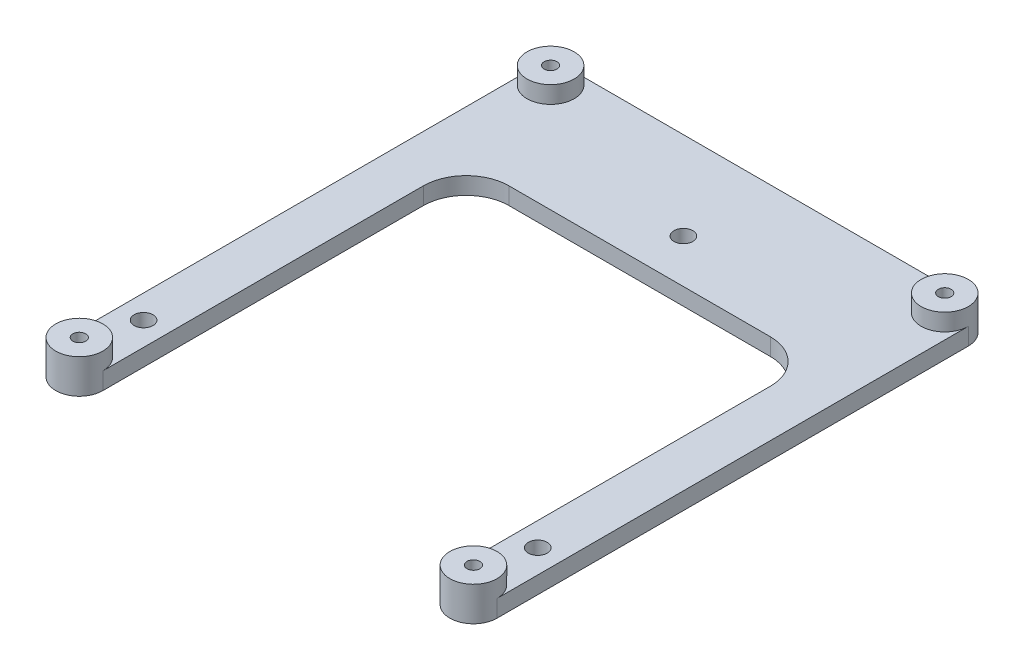
ISO-10303-21;
HEADER;
FILE_DESCRIPTION(('STEP AP214'),'2;1');
FILE_NAME('part.step','',(''),(''),'','','');
FILE_SCHEMA(('AUTOMOTIVE_DESIGN { 1 0 10303 214 1 1 1 1 }'));
ENDSEC;
DATA;
#1=APPLICATION_CONTEXT('core data for automotive mechanical design processes');
#2=APPLICATION_PROTOCOL_DEFINITION('international standard','automotive_design',2000,#1);
#3=PRODUCT_CONTEXT('',#1,'mechanical');
#4=PRODUCT('Part','Part','',(#3));
#5=PRODUCT_RELATED_PRODUCT_CATEGORY('part','',(#4));
#6=PRODUCT_DEFINITION_FORMATION('','',#4);
#7=PRODUCT_DEFINITION_CONTEXT('part definition',#1,'design');
#8=PRODUCT_DEFINITION('design','',#6,#7);
#9=PRODUCT_DEFINITION_SHAPE('','',#8);
#10=(LENGTH_UNIT() NAMED_UNIT(*) SI_UNIT(.MILLI.,.METRE.));
#11=(NAMED_UNIT(*) PLANE_ANGLE_UNIT() SI_UNIT($,.RADIAN.));
#12=(NAMED_UNIT(*) SI_UNIT($,.STERADIAN.) SOLID_ANGLE_UNIT());
#13=UNCERTAINTY_MEASURE_WITH_UNIT(LENGTH_MEASURE(1.E-05),#10,'distance_accuracy_value','');
#14=(GEOMETRIC_REPRESENTATION_CONTEXT(3) GLOBAL_UNCERTAINTY_ASSIGNED_CONTEXT((#13)) GLOBAL_UNIT_ASSIGNED_CONTEXT((#10,
#11,#12)) REPRESENTATION_CONTEXT('',''));
#15=CARTESIAN_POINT('',(0.,0.,0.));
#16=DIRECTION('',(0.,0.,1.));
#17=DIRECTION('',(1.,0.,0.));
#18=AXIS2_PLACEMENT_3D('',#15,#16,#17);
#19=CARTESIAN_POINT('',(0.,2.,0.));
#20=DIRECTION('',(0.,-1.,0.));
#21=DIRECTION('',(0.,0.,-1.));
#22=AXIS2_PLACEMENT_3D('',#19,#20,#21);
#23=PLANE('',#22);
#24=CARTESIAN_POINT('',(0.,2.,0.));
#25=DIRECTION('',(0.,1.,0.));
#26=DIRECTION('',(0.,0.,1.));
#27=AXIS2_PLACEMENT_3D('',#24,#25,#26);
#28=CIRCLE('',#27,1.1);
#29=CARTESIAN_POINT('',(0.,2.,1.1));
#30=VERTEX_POINT('',#29);
#31=EDGE_CURVE('E571',#30,#30,#28,.T.);
#32=ORIENTED_EDGE('',*,*,#31,.F.);
#33=EDGE_LOOP('',(#32));
#34=FACE_BOUND('',#33,.T.);
#35=CARTESIAN_POINT('',(46.,2.,0.));
#36=DIRECTION('',(0.,1.,0.));
#37=DIRECTION('',(0.,0.,1.));
#38=AXIS2_PLACEMENT_3D('',#35,#36,#37);
#39=CIRCLE('',#38,1.1);
#40=CARTESIAN_POINT('',(46.,2.,1.1));
#41=VERTEX_POINT('',#40);
#42=EDGE_CURVE('E576',#41,#41,#39,.T.);
#43=ORIENTED_EDGE('',*,*,#42,.F.);
#44=EDGE_LOOP('',(#43));
#45=FACE_BOUND('',#44,.T.);
#46=CARTESIAN_POINT('',(23.,2.,-40.));
#47=DIRECTION('',(0.,1.,0.));
#48=DIRECTION('',(0.,0.,1.));
#49=AXIS2_PLACEMENT_3D('',#46,#47,#48);
#50=CIRCLE('',#49,1.09999999999999);
#51=CARTESIAN_POINT('',(23.,2.,-38.9));
#52=VERTEX_POINT('',#51);
#53=EDGE_CURVE('E570',#52,#52,#50,.T.);
#54=ORIENTED_EDGE('',*,*,#53,.F.);
#55=EDGE_LOOP('',(#54));
#56=FACE_BOUND('',#55,.T.);
#57=DIRECTION('',(0.,0.,1.));
#58=VECTOR('',#57,1.);
#59=CARTESIAN_POINT('',(2.75,2.,0.));
#60=LINE('',#59,#58);
#61=CARTESIAN_POINT('',(2.75,2.,-29.9));
#62=VERTEX_POINT('',#61);
#63=CARTESIAN_POINT('',(2.75,2.,7.5));
#64=VERTEX_POINT('',#63);
#65=EDGE_CURVE('E474',#62,#64,#60,.T.);
#66=ORIENTED_EDGE('',*,*,#65,.F.);
#67=CARTESIAN_POINT('',(7.75,2.,-29.9));
#68=DIRECTION('',(0.,-1.,0.));
#69=DIRECTION('',(0.,0.,-1.));
#70=AXIS2_PLACEMENT_3D('',#67,#68,#69);
#71=CIRCLE('',#70,5.);
#72=CARTESIAN_POINT('',(7.75,2.,-34.9));
#73=VERTEX_POINT('',#72);
#74=EDGE_CURVE('E12',#62,#73,#71,.T.);
#75=ORIENTED_EDGE('',*,*,#74,.T.);
#76=DIRECTION('',(-1.,0.,0.));
#77=VECTOR('',#76,1.);
#78=CARTESIAN_POINT('',(0.,2.,-34.9));
#79=LINE('',#78,#77);
#80=CARTESIAN_POINT('',(38.25,2.,-34.9));
#81=VERTEX_POINT('',#80);
#82=EDGE_CURVE('E477',#81,#73,#79,.T.);
#83=ORIENTED_EDGE('',*,*,#82,.F.);
#84=CARTESIAN_POINT('',(38.25,2.,-29.9));
#85=DIRECTION('',(0.,-1.,0.));
#86=DIRECTION('',(0.,0.,-1.));
#87=AXIS2_PLACEMENT_3D('',#84,#85,#86);
#88=CIRCLE('',#87,5.);
#89=CARTESIAN_POINT('',(43.25,2.,-29.9));
#90=VERTEX_POINT('',#89);
#91=EDGE_CURVE('E148',#81,#90,#88,.T.);
#92=ORIENTED_EDGE('',*,*,#91,.T.);
#93=DIRECTION('',(0.,0.,-1.));
#94=VECTOR('',#93,1.);
#95=CARTESIAN_POINT('',(43.25,2.,0.));
#96=LINE('',#95,#94);
#97=CARTESIAN_POINT('',(43.25,2.,7.5));
#98=VERTEX_POINT('',#97);
#99=EDGE_CURVE('E132',#98,#90,#96,.T.);
#100=ORIENTED_EDGE('',*,*,#99,.F.);
#101=CARTESIAN_POINT('',(46.,2.,7.5));
#102=DIRECTION('',(0.,-1.,0.));
#103=DIRECTION('',(0.,0.,-1.));
#104=AXIS2_PLACEMENT_3D('',#101,#102,#103);
#105=CIRCLE('',#104,2.75);
#106=CARTESIAN_POINT('',(48.75,2.,7.5));
#107=VERTEX_POINT('',#106);
#108=EDGE_CURVE('E145',#107,#98,#105,.F.);
#109=ORIENTED_EDGE('',*,*,#108,.F.);
#110=DIRECTION('',(0.,0.,1.));
#111=VECTOR('',#110,1.);
#112=CARTESIAN_POINT('',(48.75,2.,0.));
#113=LINE('',#112,#111);
#114=CARTESIAN_POINT('',(48.75,2.,-47.5));
#115=VERTEX_POINT('',#114);
#116=EDGE_CURVE('E535',#115,#107,#113,.T.);
#117=ORIENTED_EDGE('',*,*,#116,.F.);
#118=CARTESIAN_POINT('',(46.,2.,-47.5));
#119=DIRECTION('',(0.,-1.,0.));
#120=DIRECTION('',(0.,0.,-1.));
#121=AXIS2_PLACEMENT_3D('',#118,#119,#120);
#122=CIRCLE('',#121,2.75);
#123=CARTESIAN_POINT('',(46.,2.,-50.25));
#124=VERTEX_POINT('',#123);
#125=EDGE_CURVE('E157',#124,#115,#122,.F.);
#126=ORIENTED_EDGE('',*,*,#125,.F.);
#127=DIRECTION('',(1.,0.,0.));
#128=VECTOR('',#127,1.);
#129=CARTESIAN_POINT('',(0.,2.,-50.25));
#130=LINE('',#129,#128);
#131=CARTESIAN_POINT('',(0.,2.,-50.25));
#132=VERTEX_POINT('',#131);
#133=EDGE_CURVE('E532',#132,#124,#130,.T.);
#134=ORIENTED_EDGE('',*,*,#133,.F.);
#135=CARTESIAN_POINT('',(0.,2.,-47.5));
#136=DIRECTION('',(0.,-1.,0.));
#137=DIRECTION('',(0.,0.,-1.));
#138=AXIS2_PLACEMENT_3D('',#135,#136,#137);
#139=CIRCLE('',#138,2.75);
#140=CARTESIAN_POINT('',(-2.75,2.,-47.5));
#141=VERTEX_POINT('',#140);
#142=EDGE_CURVE('E163',#141,#132,#139,.F.);
#143=ORIENTED_EDGE('',*,*,#142,.F.);
#144=DIRECTION('',(0.,0.,-1.));
#145=VECTOR('',#144,1.);
#146=CARTESIAN_POINT('',(-2.75,2.,0.));
#147=LINE('',#146,#145);
#148=CARTESIAN_POINT('',(-2.75,2.,7.5));
#149=VERTEX_POINT('',#148);
#150=EDGE_CURVE('E513',#149,#141,#147,.T.);
#151=ORIENTED_EDGE('',*,*,#150,.F.);
#152=CARTESIAN_POINT('',(0.,2.,7.5));
#153=DIRECTION('',(0.,-1.,0.));
#154=DIRECTION('',(0.,0.,-1.));
#155=AXIS2_PLACEMENT_3D('',#152,#153,#154);
#156=CIRCLE('',#155,2.75);
#157=EDGE_CURVE('E158',#64,#149,#156,.F.);
#158=ORIENTED_EDGE('',*,*,#157,.F.);
#159=EDGE_LOOP('',(#66,#75,#83,#92,#100,#109,#117,#126,#134,#143,#151,#158));
#160=FACE_BOUND('',#159,.T.);
#161=ADVANCED_FACE('F39',(#34,#45,#56,#160),#23,.F.);
#162=CARTESIAN_POINT('',(0.,0.,0.));
#163=DIRECTION('',(0.,-1.,0.));
#164=DIRECTION('',(0.,0.,-1.));
#165=AXIS2_PLACEMENT_3D('',#162,#163,#164);
#166=PLANE('',#165);
#167=CARTESIAN_POINT('',(0.,0.,7.5));
#168=DIRECTION('',(0.,1.,0.));
#169=DIRECTION('',(0.,0.,1.));
#170=AXIS2_PLACEMENT_3D('',#167,#168,#169);
#171=CIRCLE('',#170,0.75);
#172=CARTESIAN_POINT('',(0.,0.,8.25));
#173=VERTEX_POINT('',#172);
#174=EDGE_CURVE('E583',#173,#173,#171,.T.);
#175=ORIENTED_EDGE('',*,*,#174,.T.);
#176=EDGE_LOOP('',(#175));
#177=FACE_BOUND('',#176,.T.);
#178=CARTESIAN_POINT('',(46.,0.,-47.5));
#179=DIRECTION('',(0.,1.,0.));
#180=DIRECTION('',(0.,0.,1.));
#181=AXIS2_PLACEMENT_3D('',#178,#179,#180);
#182=CIRCLE('',#181,0.749999999999999);
#183=CARTESIAN_POINT('',(46.,0.,-46.75));
#184=VERTEX_POINT('',#183);
#185=EDGE_CURVE('E592',#184,#184,#182,.T.);
#186=ORIENTED_EDGE('',*,*,#185,.T.);
#187=EDGE_LOOP('',(#186));
#188=FACE_BOUND('',#187,.T.);
#189=CARTESIAN_POINT('',(46.,0.,7.5));
#190=DIRECTION('',(0.,1.,0.));
#191=DIRECTION('',(0.,0.,1.));
#192=AXIS2_PLACEMENT_3D('',#189,#190,#191);
#193=CIRCLE('',#192,0.749999999999999);
#194=CARTESIAN_POINT('',(46.,0.,8.25));
#195=VERTEX_POINT('',#194);
#196=EDGE_CURVE('E165',#195,#195,#193,.T.);
#197=ORIENTED_EDGE('',*,*,#196,.T.);
#198=EDGE_LOOP('',(#197));
#199=FACE_BOUND('',#198,.T.);
#200=CARTESIAN_POINT('',(0.,0.,-47.5));
#201=DIRECTION('',(0.,1.,0.));
#202=DIRECTION('',(0.,0.,1.));
#203=AXIS2_PLACEMENT_3D('',#200,#201,#202);
#204=CIRCLE('',#203,0.75);
#205=CARTESIAN_POINT('',(0.,0.,-46.75));
#206=VERTEX_POINT('',#205);
#207=EDGE_CURVE('E587',#206,#206,#204,.T.);
#208=ORIENTED_EDGE('',*,*,#207,.T.);
#209=EDGE_LOOP('',(#208));
#210=FACE_BOUND('',#209,.T.);
#211=CARTESIAN_POINT('',(23.,0.,-40.));
#212=DIRECTION('',(0.,-1.,0.));
#213=DIRECTION('',(0.,0.,-1.));
#214=AXIS2_PLACEMENT_3D('',#211,#212,#213);
#215=CIRCLE('',#214,1.09999999999999);
#216=CARTESIAN_POINT('',(23.,0.,-41.1));
#217=VERTEX_POINT('',#216);
#218=EDGE_CURVE('E575',#217,#217,#215,.T.);
#219=ORIENTED_EDGE('',*,*,#218,.F.);
#220=EDGE_LOOP('',(#219));
#221=FACE_BOUND('',#220,.T.);
#222=CARTESIAN_POINT('',(46.,0.,0.));
#223=DIRECTION('',(0.,-1.,0.));
#224=DIRECTION('',(0.,0.,-1.));
#225=AXIS2_PLACEMENT_3D('',#222,#223,#224);
#226=CIRCLE('',#225,1.1);
#227=CARTESIAN_POINT('',(46.,0.,-1.1));
#228=VERTEX_POINT('',#227);
#229=EDGE_CURVE('E602',#228,#228,#226,.T.);
#230=ORIENTED_EDGE('',*,*,#229,.F.);
#231=EDGE_LOOP('',(#230));
#232=FACE_BOUND('',#231,.T.);
#233=CARTESIAN_POINT('',(0.,0.,0.));
#234=DIRECTION('',(0.,-1.,0.));
#235=DIRECTION('',(0.,0.,-1.));
#236=AXIS2_PLACEMENT_3D('',#233,#234,#235);
#237=CIRCLE('',#236,1.1);
#238=CARTESIAN_POINT('',(0.,0.,-1.1));
#239=VERTEX_POINT('',#238);
#240=EDGE_CURVE('E588',#239,#239,#237,.T.);
#241=ORIENTED_EDGE('',*,*,#240,.F.);
#242=EDGE_LOOP('',(#241));
#243=FACE_BOUND('',#242,.T.);
#244=DIRECTION('',(-1.,0.,0.));
#245=VECTOR('',#244,1.);
#246=CARTESIAN_POINT('',(0.,0.,-34.9));
#247=LINE('',#246,#245);
#248=CARTESIAN_POINT('',(38.25,0.,-34.9));
#249=VERTEX_POINT('',#248);
#250=CARTESIAN_POINT('',(7.75,0.,-34.9));
#251=VERTEX_POINT('',#250);
#252=EDGE_CURVE('E172',#249,#251,#247,.T.);
#253=ORIENTED_EDGE('',*,*,#252,.T.);
#254=CARTESIAN_POINT('',(7.75,0.,-29.9));
#255=DIRECTION('',(0.,-1.,0.));
#256=DIRECTION('',(0.,0.,-1.));
#257=AXIS2_PLACEMENT_3D('',#254,#255,#256);
#258=CIRCLE('',#257,5.);
#259=CARTESIAN_POINT('',(2.75,0.,-29.9));
#260=VERTEX_POINT('',#259);
#261=EDGE_CURVE('E48',#251,#260,#258,.F.);
#262=ORIENTED_EDGE('',*,*,#261,.T.);
#263=DIRECTION('',(0.,0.,1.));
#264=VECTOR('',#263,1.);
#265=CARTESIAN_POINT('',(2.75,0.,0.));
#266=LINE('',#265,#264);
#267=CARTESIAN_POINT('',(2.75,0.,7.5));
#268=VERTEX_POINT('',#267);
#269=EDGE_CURVE('E150',#260,#268,#266,.T.);
#270=ORIENTED_EDGE('',*,*,#269,.T.);
#271=CARTESIAN_POINT('',(0.,0.,7.5));
#272=DIRECTION('',(0.,1.,0.));
#273=DIRECTION('',(0.,0.,1.));
#274=AXIS2_PLACEMENT_3D('',#271,#272,#273);
#275=CIRCLE('',#274,2.75);
#276=CARTESIAN_POINT('',(-2.75,0.,7.5));
#277=VERTEX_POINT('',#276);
#278=EDGE_CURVE('E491',#277,#268,#275,.T.);
#279=ORIENTED_EDGE('',*,*,#278,.F.);
#280=DIRECTION('',(0.,0.,1.));
#281=VECTOR('',#280,1.);
#282=CARTESIAN_POINT('',(-2.75,0.,-47.5));
#283=LINE('',#282,#281);
#284=CARTESIAN_POINT('',(-2.75,0.,-47.5));
#285=VERTEX_POINT('',#284);
#286=EDGE_CURVE('E484',#285,#277,#283,.T.);
#287=ORIENTED_EDGE('',*,*,#286,.F.);
#288=CARTESIAN_POINT('',(0.,0.,-47.5));
#289=DIRECTION('',(0.,1.,0.));
#290=DIRECTION('',(0.,0.,-1.));
#291=AXIS2_PLACEMENT_3D('',#288,#289,#290);
#292=CIRCLE('',#291,2.75);
#293=CARTESIAN_POINT('',(0.,0.,-50.25));
#294=VERTEX_POINT('',#293);
#295=EDGE_CURVE('E480',#294,#285,#292,.T.);
#296=ORIENTED_EDGE('',*,*,#295,.F.);
#297=DIRECTION('',(-1.,0.,0.));
#298=VECTOR('',#297,1.);
#299=CARTESIAN_POINT('',(46.,0.,-50.25));
#300=LINE('',#299,#298);
#301=CARTESIAN_POINT('',(46.,0.,-50.25));
#302=VERTEX_POINT('',#301);
#303=EDGE_CURVE('E505',#302,#294,#300,.T.);
#304=ORIENTED_EDGE('',*,*,#303,.F.);
#305=CARTESIAN_POINT('',(46.,0.,-47.5));
#306=DIRECTION('',(0.,1.,0.));
#307=DIRECTION('',(0.,0.,1.));
#308=AXIS2_PLACEMENT_3D('',#305,#306,#307);
#309=CIRCLE('',#308,2.75);
#310=CARTESIAN_POINT('',(48.75,0.,-47.5));
#311=VERTEX_POINT('',#310);
#312=EDGE_CURVE('E501',#311,#302,#309,.T.);
#313=ORIENTED_EDGE('',*,*,#312,.F.);
#314=DIRECTION('',(0.,0.,-1.));
#315=VECTOR('',#314,1.);
#316=CARTESIAN_POINT('',(48.75,0.,7.5));
#317=LINE('',#316,#315);
#318=CARTESIAN_POINT('',(48.75,0.,7.5));
#319=VERTEX_POINT('',#318);
#320=EDGE_CURVE('E497',#319,#311,#317,.T.);
#321=ORIENTED_EDGE('',*,*,#320,.F.);
#322=CARTESIAN_POINT('',(46.,0.,7.5));
#323=DIRECTION('',(0.,1.,0.));
#324=DIRECTION('',(0.,0.,-1.));
#325=AXIS2_PLACEMENT_3D('',#322,#323,#324);
#326=CIRCLE('',#325,2.75);
#327=CARTESIAN_POINT('',(43.25,0.,7.5));
#328=VERTEX_POINT('',#327);
#329=EDGE_CURVE('E494',#328,#319,#326,.T.);
#330=ORIENTED_EDGE('',*,*,#329,.F.);
#331=DIRECTION('',(0.,0.,-1.));
#332=VECTOR('',#331,1.);
#333=CARTESIAN_POINT('',(43.25,0.,0.));
#334=LINE('',#333,#332);
#335=CARTESIAN_POINT('',(43.25,0.,-29.9));
#336=VERTEX_POINT('',#335);
#337=EDGE_CURVE('E135',#328,#336,#334,.T.);
#338=ORIENTED_EDGE('',*,*,#337,.T.);
#339=CARTESIAN_POINT('',(38.25,0.,-29.9));
#340=DIRECTION('',(0.,-1.,0.));
#341=DIRECTION('',(0.,0.,-1.));
#342=AXIS2_PLACEMENT_3D('',#339,#340,#341);
#343=CIRCLE('',#342,5.);
#344=EDGE_CURVE('E187',#336,#249,#343,.F.);
#345=ORIENTED_EDGE('',*,*,#344,.T.);
#346=EDGE_LOOP('',(#253,#262,#270,#279,#287,#296,#304,#313,#321,#330,#338,#345));
#347=FACE_BOUND('',#346,.T.);
#348=ADVANCED_FACE('F193',(#177,#188,#199,#210,#221,#232,#243,#347),#166,.T.);
#349=CARTESIAN_POINT('',(46.,2.,7.5));
#350=DIRECTION('',(0.,-1.,0.));
#351=DIRECTION('',(0.,0.,-1.));
#352=AXIS2_PLACEMENT_3D('',#349,#350,#351);
#353=CYLINDRICAL_SURFACE('',#352,0.749999999999999);
#354=ORIENTED_EDGE('',*,*,#196,.F.);
#355=EDGE_LOOP('',(#354));
#356=FACE_BOUND('',#355,.T.);
#357=CARTESIAN_POINT('',(46.,4.,7.5));
#358=DIRECTION('',(0.,1.,0.));
#359=DIRECTION('',(0.,0.,1.));
#360=AXIS2_PLACEMENT_3D('',#357,#358,#359);
#361=CIRCLE('',#360,0.749999999999999);
#362=CARTESIAN_POINT('',(46.,4.,8.25));
#363=VERTEX_POINT('',#362);
#364=EDGE_CURVE('E554',#363,#363,#361,.T.);
#365=ORIENTED_EDGE('',*,*,#364,.T.);
#366=EDGE_LOOP('',(#365));
#367=FACE_BOUND('',#366,.T.);
#368=ADVANCED_FACE('F216',(#356,#367),#353,.F.);
#369=CARTESIAN_POINT('',(46.,2.,-47.5));
#370=DIRECTION('',(0.,-1.,0.));
#371=DIRECTION('',(0.,0.,-1.));
#372=AXIS2_PLACEMENT_3D('',#369,#370,#371);
#373=CYLINDRICAL_SURFACE('',#372,0.749999999999999);
#374=ORIENTED_EDGE('',*,*,#185,.F.);
#375=EDGE_LOOP('',(#374));
#376=FACE_BOUND('',#375,.T.);
#377=CARTESIAN_POINT('',(46.,4.,-47.5));
#378=DIRECTION('',(0.,1.,0.));
#379=DIRECTION('',(0.,0.,1.));
#380=AXIS2_PLACEMENT_3D('',#377,#378,#379);
#381=CIRCLE('',#380,0.749999999999999);
#382=CARTESIAN_POINT('',(46.,4.,-46.75));
#383=VERTEX_POINT('',#382);
#384=EDGE_CURVE('E546',#383,#383,#381,.T.);
#385=ORIENTED_EDGE('',*,*,#384,.T.);
#386=EDGE_LOOP('',(#385));
#387=FACE_BOUND('',#386,.T.);
#388=ADVANCED_FACE('F223',(#376,#387),#373,.F.);
#389=CARTESIAN_POINT('',(0.,2.,-47.5));
#390=DIRECTION('',(0.,-1.,0.));
#391=DIRECTION('',(0.,0.,-1.));
#392=AXIS2_PLACEMENT_3D('',#389,#390,#391);
#393=CYLINDRICAL_SURFACE('',#392,0.75);
#394=ORIENTED_EDGE('',*,*,#207,.F.);
#395=EDGE_LOOP('',(#394));
#396=FACE_BOUND('',#395,.T.);
#397=CARTESIAN_POINT('',(0.,4.,-47.5));
#398=DIRECTION('',(0.,1.,0.));
#399=DIRECTION('',(0.,0.,1.));
#400=AXIS2_PLACEMENT_3D('',#397,#398,#399);
#401=CIRCLE('',#400,0.750000000000001);
#402=CARTESIAN_POINT('',(0.,4.,-46.75));
#403=VERTEX_POINT('',#402);
#404=EDGE_CURVE('E538',#403,#403,#401,.T.);
#405=ORIENTED_EDGE('',*,*,#404,.T.);
#406=EDGE_LOOP('',(#405));
#407=FACE_BOUND('',#406,.T.);
#408=ADVANCED_FACE('F227',(#396,#407),#393,.F.);
#409=CARTESIAN_POINT('',(0.,2.,7.5));
#410=DIRECTION('',(0.,-1.,0.));
#411=DIRECTION('',(0.,0.,-1.));
#412=AXIS2_PLACEMENT_3D('',#409,#410,#411);
#413=CYLINDRICAL_SURFACE('',#412,0.75);
#414=ORIENTED_EDGE('',*,*,#174,.F.);
#415=EDGE_LOOP('',(#414));
#416=FACE_BOUND('',#415,.T.);
#417=CARTESIAN_POINT('',(0.,4.,7.5));
#418=DIRECTION('',(0.,1.,0.));
#419=DIRECTION('',(0.,0.,1.));
#420=AXIS2_PLACEMENT_3D('',#417,#418,#419);
#421=CIRCLE('',#420,0.750000000000001);
#422=CARTESIAN_POINT('',(0.,4.,8.25));
#423=VERTEX_POINT('',#422);
#424=EDGE_CURVE('E562',#423,#423,#421,.T.);
#425=ORIENTED_EDGE('',*,*,#424,.T.);
#426=EDGE_LOOP('',(#425));
#427=FACE_BOUND('',#426,.T.);
#428=ADVANCED_FACE('F231',(#416,#427),#413,.F.);
#429=CARTESIAN_POINT('',(23.,-1.2E-05,-40.));
#430=DIRECTION('',(0.,1.,0.));
#431=DIRECTION('',(0.,0.,1.));
#432=AXIS2_PLACEMENT_3D('',#429,#430,#431);
#433=CYLINDRICAL_SURFACE('',#432,1.09999999999999);
#434=ORIENTED_EDGE('',*,*,#218,.T.);
#435=EDGE_LOOP('',(#434));
#436=FACE_BOUND('',#435,.T.);
#437=ORIENTED_EDGE('',*,*,#53,.T.);
#438=EDGE_LOOP('',(#437));
#439=FACE_BOUND('',#438,.T.);
#440=ADVANCED_FACE('F235',(#436,#439),#433,.F.);
#441=CARTESIAN_POINT('',(46.,-1.2E-05,0.));
#442=DIRECTION('',(0.,1.,0.));
#443=DIRECTION('',(0.,0.,1.));
#444=AXIS2_PLACEMENT_3D('',#441,#442,#443);
#445=CYLINDRICAL_SURFACE('',#444,1.1);
#446=ORIENTED_EDGE('',*,*,#229,.T.);
#447=EDGE_LOOP('',(#446));
#448=FACE_BOUND('',#447,.T.);
#449=ORIENTED_EDGE('',*,*,#42,.T.);
#450=EDGE_LOOP('',(#449));
#451=FACE_BOUND('',#450,.T.);
#452=ADVANCED_FACE('F239',(#448,#451),#445,.F.);
#453=CARTESIAN_POINT('',(0.,-1.2E-05,0.));
#454=DIRECTION('',(0.,1.,0.));
#455=DIRECTION('',(0.,0.,1.));
#456=AXIS2_PLACEMENT_3D('',#453,#454,#455);
#457=CYLINDRICAL_SURFACE('',#456,1.1);
#458=ORIENTED_EDGE('',*,*,#240,.T.);
#459=EDGE_LOOP('',(#458));
#460=FACE_BOUND('',#459,.T.);
#461=ORIENTED_EDGE('',*,*,#31,.T.);
#462=EDGE_LOOP('',(#461));
#463=FACE_BOUND('',#462,.T.);
#464=ADVANCED_FACE('F243',(#460,#463),#457,.F.);
#465=CARTESIAN_POINT('',(0.,4.,7.5));
#466=DIRECTION('',(0.,1.,0.));
#467=DIRECTION('',(0.,0.,1.));
#468=AXIS2_PLACEMENT_3D('',#465,#466,#467);
#469=PLANE('',#468);
#470=CARTESIAN_POINT('',(0.,4.,7.5));
#471=DIRECTION('',(0.,1.,0.));
#472=DIRECTION('',(0.,0.,1.));
#473=AXIS2_PLACEMENT_3D('',#470,#471,#472);
#474=CIRCLE('',#473,2.75);
#475=CARTESIAN_POINT('',(0.,4.,10.25));
#476=VERTEX_POINT('',#475);
#477=EDGE_CURVE('E566',#476,#476,#474,.T.);
#478=ORIENTED_EDGE('',*,*,#477,.T.);
#479=EDGE_LOOP('',(#478));
#480=FACE_BOUND('',#479,.T.);
#481=ORIENTED_EDGE('',*,*,#424,.F.);
#482=EDGE_LOOP('',(#481));
#483=FACE_BOUND('',#482,.T.);
#484=ADVANCED_FACE('F247',(#480,#483),#469,.T.);
#485=CARTESIAN_POINT('',(0.,4.,7.5));
#486=DIRECTION('',(0.,-1.,0.));
#487=DIRECTION('',(0.,0.,-1.));
#488=AXIS2_PLACEMENT_3D('',#485,#486,#487);
#489=CYLINDRICAL_SURFACE('',#488,2.75);
#490=DIRECTION('',(0.,-1.,0.));
#491=VECTOR('',#490,1.);
#492=CARTESIAN_POINT('',(2.75,101.439837338966,7.5));
#493=LINE('',#492,#491);
#494=EDGE_CURVE('E140',#64,#268,#493,.T.);
#495=ORIENTED_EDGE('',*,*,#494,.F.);
#496=ORIENTED_EDGE('',*,*,#157,.T.);
#497=DIRECTION('',(0.,1.,0.));
#498=VECTOR('',#497,1.);
#499=CARTESIAN_POINT('',(-2.75,0.,7.5));
#500=LINE('',#499,#498);
#501=EDGE_CURVE('E523',#277,#149,#500,.T.);
#502=ORIENTED_EDGE('',*,*,#501,.F.);
#503=ORIENTED_EDGE('',*,*,#278,.T.);
#504=EDGE_LOOP('',(#495,#496,#502,#503));
#505=FACE_BOUND('',#504,.T.);
#506=ORIENTED_EDGE('',*,*,#477,.F.);
#507=EDGE_LOOP('',(#506));
#508=FACE_BOUND('',#507,.T.);
#509=ADVANCED_FACE('F249',(#505,#508),#489,.T.);
#510=CARTESIAN_POINT('',(46.,4.,7.5));
#511=DIRECTION('',(0.,1.,0.));
#512=DIRECTION('',(0.,0.,1.));
#513=AXIS2_PLACEMENT_3D('',#510,#511,#512);
#514=PLANE('',#513);
#515=CARTESIAN_POINT('',(46.,4.,7.5));
#516=DIRECTION('',(0.,1.,0.));
#517=DIRECTION('',(0.,0.,1.));
#518=AXIS2_PLACEMENT_3D('',#515,#516,#517);
#519=CIRCLE('',#518,2.75);
#520=CARTESIAN_POINT('',(46.,4.,10.25));
#521=VERTEX_POINT('',#520);
#522=EDGE_CURVE('E558',#521,#521,#519,.T.);
#523=ORIENTED_EDGE('',*,*,#522,.T.);
#524=EDGE_LOOP('',(#523));
#525=FACE_BOUND('',#524,.T.);
#526=ORIENTED_EDGE('',*,*,#364,.F.);
#527=EDGE_LOOP('',(#526));
#528=FACE_BOUND('',#527,.T.);
#529=ADVANCED_FACE('F252',(#525,#528),#514,.T.);
#530=CARTESIAN_POINT('',(46.,4.,7.5));
#531=DIRECTION('',(0.,-1.,0.));
#532=DIRECTION('',(0.,0.,-1.));
#533=AXIS2_PLACEMENT_3D('',#530,#531,#532);
#534=CYLINDRICAL_SURFACE('',#533,2.75);
#535=ORIENTED_EDGE('',*,*,#108,.T.);
#536=DIRECTION('',(0.,-1.,0.));
#537=VECTOR('',#536,1.);
#538=CARTESIAN_POINT('',(43.25,101.439837338966,7.5));
#539=LINE('',#538,#537);
#540=EDGE_CURVE('E128',#98,#328,#539,.T.);
#541=ORIENTED_EDGE('',*,*,#540,.T.);
#542=ORIENTED_EDGE('',*,*,#329,.T.);
#543=DIRECTION('',(0.,1.,0.));
#544=VECTOR('',#543,1.);
#545=CARTESIAN_POINT('',(48.75,0.,7.5));
#546=LINE('',#545,#544);
#547=EDGE_CURVE('E155',#319,#107,#546,.T.);
#548=ORIENTED_EDGE('',*,*,#547,.T.);
#549=EDGE_LOOP('',(#535,#541,#542,#548));
#550=FACE_BOUND('',#549,.T.);
#551=ORIENTED_EDGE('',*,*,#522,.F.);
#552=EDGE_LOOP('',(#551));
#553=FACE_BOUND('',#552,.T.);
#554=ADVANCED_FACE('F153',(#550,#553),#534,.T.);
#555=CARTESIAN_POINT('',(46.,4.,-47.5));
#556=DIRECTION('',(0.,1.,0.));
#557=DIRECTION('',(0.,0.,1.));
#558=AXIS2_PLACEMENT_3D('',#555,#556,#557);
#559=PLANE('',#558);
#560=CARTESIAN_POINT('',(46.,4.,-47.5));
#561=DIRECTION('',(0.,1.,0.));
#562=DIRECTION('',(0.,0.,1.));
#563=AXIS2_PLACEMENT_3D('',#560,#561,#562);
#564=CIRCLE('',#563,2.75);
#565=CARTESIAN_POINT('',(46.,4.,-44.75));
#566=VERTEX_POINT('',#565);
#567=EDGE_CURVE('E550',#566,#566,#564,.T.);
#568=ORIENTED_EDGE('',*,*,#567,.T.);
#569=EDGE_LOOP('',(#568));
#570=FACE_BOUND('',#569,.T.);
#571=ORIENTED_EDGE('',*,*,#384,.F.);
#572=EDGE_LOOP('',(#571));
#573=FACE_BOUND('',#572,.T.);
#574=ADVANCED_FACE('F259',(#570,#573),#559,.T.);
#575=CARTESIAN_POINT('',(46.,4.,-47.5));
#576=DIRECTION('',(0.,-1.,0.));
#577=DIRECTION('',(0.,0.,-1.));
#578=AXIS2_PLACEMENT_3D('',#575,#576,#577);
#579=CYLINDRICAL_SURFACE('',#578,2.75);
#580=ORIENTED_EDGE('',*,*,#125,.T.);
#581=DIRECTION('',(0.,1.,0.));
#582=VECTOR('',#581,1.);
#583=CARTESIAN_POINT('',(48.75,0.,-47.5));
#584=LINE('',#583,#582);
#585=EDGE_CURVE('E518',#311,#115,#584,.T.);
#586=ORIENTED_EDGE('',*,*,#585,.F.);
#587=ORIENTED_EDGE('',*,*,#312,.T.);
#588=DIRECTION('',(0.,1.,0.));
#589=VECTOR('',#588,1.);
#590=CARTESIAN_POINT('',(46.,0.,-50.25));
#591=LINE('',#590,#589);
#592=EDGE_CURVE('E514',#302,#124,#591,.T.);
#593=ORIENTED_EDGE('',*,*,#592,.T.);
#594=EDGE_LOOP('',(#580,#586,#587,#593));
#595=FACE_BOUND('',#594,.T.);
#596=ORIENTED_EDGE('',*,*,#567,.F.);
#597=EDGE_LOOP('',(#596));
#598=FACE_BOUND('',#597,.T.);
#599=ADVANCED_FACE('F263',(#595,#598),#579,.T.);
#600=CARTESIAN_POINT('',(0.,4.,-47.5));
#601=DIRECTION('',(0.,1.,0.));
#602=DIRECTION('',(0.,0.,1.));
#603=AXIS2_PLACEMENT_3D('',#600,#601,#602);
#604=PLANE('',#603);
#605=CARTESIAN_POINT('',(0.,4.,-47.5));
#606=DIRECTION('',(0.,1.,0.));
#607=DIRECTION('',(0.,0.,1.));
#608=AXIS2_PLACEMENT_3D('',#605,#606,#607);
#609=CIRCLE('',#608,2.75);
#610=CARTESIAN_POINT('',(0.,4.,-44.75));
#611=VERTEX_POINT('',#610);
#612=EDGE_CURVE('E542',#611,#611,#609,.T.);
#613=ORIENTED_EDGE('',*,*,#612,.T.);
#614=EDGE_LOOP('',(#613));
#615=FACE_BOUND('',#614,.T.);
#616=ORIENTED_EDGE('',*,*,#404,.F.);
#617=EDGE_LOOP('',(#616));
#618=FACE_BOUND('',#617,.T.);
#619=ADVANCED_FACE('F266',(#615,#618),#604,.T.);
#620=CARTESIAN_POINT('',(0.,4.,-47.5));
#621=DIRECTION('',(0.,-1.,0.));
#622=DIRECTION('',(0.,0.,-1.));
#623=AXIS2_PLACEMENT_3D('',#620,#621,#622);
#624=CYLINDRICAL_SURFACE('',#623,2.75);
#625=ORIENTED_EDGE('',*,*,#142,.T.);
#626=DIRECTION('',(0.,1.,0.));
#627=VECTOR('',#626,1.);
#628=CARTESIAN_POINT('',(0.,0.,-50.25));
#629=LINE('',#628,#627);
#630=EDGE_CURVE('E510',#294,#132,#629,.T.);
#631=ORIENTED_EDGE('',*,*,#630,.F.);
#632=ORIENTED_EDGE('',*,*,#295,.T.);
#633=DIRECTION('',(0.,1.,0.));
#634=VECTOR('',#633,1.);
#635=CARTESIAN_POINT('',(-2.75,0.,-47.5));
#636=LINE('',#635,#634);
#637=EDGE_CURVE('E509',#285,#141,#636,.T.);
#638=ORIENTED_EDGE('',*,*,#637,.T.);
#639=EDGE_LOOP('',(#625,#631,#632,#638));
#640=FACE_BOUND('',#639,.T.);
#641=ORIENTED_EDGE('',*,*,#612,.F.);
#642=EDGE_LOOP('',(#641));
#643=FACE_BOUND('',#642,.T.);
#644=ADVANCED_FACE('F271',(#640,#643),#624,.T.);
#645=CARTESIAN_POINT('',(48.75,0.,7.5));
#646=DIRECTION('',(1.,0.,0.));
#647=DIRECTION('',(0.,0.,-1.));
#648=AXIS2_PLACEMENT_3D('',#645,#646,#647);
#649=PLANE('',#648);
#650=ORIENTED_EDGE('',*,*,#116,.T.);
#651=ORIENTED_EDGE('',*,*,#547,.F.);
#652=ORIENTED_EDGE('',*,*,#320,.T.);
#653=ORIENTED_EDGE('',*,*,#585,.T.);
#654=EDGE_LOOP('',(#650,#651,#652,#653));
#655=FACE_BOUND('',#654,.T.);
#656=ADVANCED_FACE('F274',(#655),#649,.T.);
#657=CARTESIAN_POINT('',(46.,0.,-50.25));
#658=DIRECTION('',(0.,0.,-1.));
#659=DIRECTION('',(-1.,0.,0.));
#660=AXIS2_PLACEMENT_3D('',#657,#658,#659);
#661=PLANE('',#660);
#662=ORIENTED_EDGE('',*,*,#133,.T.);
#663=ORIENTED_EDGE('',*,*,#592,.F.);
#664=ORIENTED_EDGE('',*,*,#303,.T.);
#665=ORIENTED_EDGE('',*,*,#630,.T.);
#666=EDGE_LOOP('',(#662,#663,#664,#665));
#667=FACE_BOUND('',#666,.T.);
#668=ADVANCED_FACE('F282',(#667),#661,.T.);
#669=CARTESIAN_POINT('',(-2.75,0.,-47.5));
#670=DIRECTION('',(-1.,0.,0.));
#671=DIRECTION('',(0.,0.,1.));
#672=AXIS2_PLACEMENT_3D('',#669,#670,#671);
#673=PLANE('',#672);
#674=ORIENTED_EDGE('',*,*,#150,.T.);
#675=ORIENTED_EDGE('',*,*,#637,.F.);
#676=ORIENTED_EDGE('',*,*,#286,.T.);
#677=ORIENTED_EDGE('',*,*,#501,.T.);
#678=EDGE_LOOP('',(#674,#675,#676,#677));
#679=FACE_BOUND('',#678,.T.);
#680=ADVANCED_FACE('F279',(#679),#673,.T.);
#681=CARTESIAN_POINT('',(2.75,101.439837338966,-34.9));
#682=DIRECTION('',(0.,0.,1.));
#683=DIRECTION('',(1.,0.,0.));
#684=AXIS2_PLACEMENT_3D('',#681,#682,#683);
#685=PLANE('',#684);
#686=ORIENTED_EDGE('',*,*,#252,.F.);
#687=DIRECTION('',(0.,-1.,0.));
#688=VECTOR('',#687,1.);
#689=CARTESIAN_POINT('',(38.25,2.,-34.9));
#690=LINE('',#689,#688);
#691=EDGE_CURVE('E182',#249,#81,#690,.F.);
#692=ORIENTED_EDGE('',*,*,#691,.T.);
#693=ORIENTED_EDGE('',*,*,#82,.T.);
#694=DIRECTION('',(0.,-1.,0.));
#695=VECTOR('',#694,1.);
#696=CARTESIAN_POINT('',(7.75,0.,-34.9));
#697=LINE('',#696,#695);
#698=EDGE_CURVE('E178',#73,#251,#697,.T.);
#699=ORIENTED_EDGE('',*,*,#698,.T.);
#700=EDGE_LOOP('',(#686,#692,#693,#699));
#701=FACE_BOUND('',#700,.T.);
#702=ADVANCED_FACE('F197',(#701),#685,.T.);
#703=CARTESIAN_POINT('',(2.75,101.439837338966,7.5));
#704=DIRECTION('',(1.,0.,0.));
#705=DIRECTION('',(0.,0.,-1.));
#706=AXIS2_PLACEMENT_3D('',#703,#704,#705);
#707=PLANE('',#706);
#708=ORIENTED_EDGE('',*,*,#269,.F.);
#709=DIRECTION('',(0.,-1.,0.));
#710=VECTOR('',#709,1.);
#711=CARTESIAN_POINT('',(2.75,2.,-29.9));
#712=LINE('',#711,#710);
#713=EDGE_CURVE('E61',#260,#62,#712,.F.);
#714=ORIENTED_EDGE('',*,*,#713,.T.);
#715=ORIENTED_EDGE('',*,*,#65,.T.);
#716=ORIENTED_EDGE('',*,*,#494,.T.);
#717=EDGE_LOOP('',(#708,#714,#715,#716));
#718=FACE_BOUND('',#717,.T.);
#719=ADVANCED_FACE('F207',(#718),#707,.T.);
#720=CARTESIAN_POINT('',(43.25,101.439837338966,-34.9));
#721=DIRECTION('',(-1.,0.,0.));
#722=DIRECTION('',(0.,0.,1.));
#723=AXIS2_PLACEMENT_3D('',#720,#721,#722);
#724=PLANE('',#723);
#725=ORIENTED_EDGE('',*,*,#99,.T.);
#726=DIRECTION('',(0.,-1.,0.));
#727=VECTOR('',#726,1.);
#728=CARTESIAN_POINT('',(43.25,0.,-29.9));
#729=LINE('',#728,#727);
#730=EDGE_CURVE('E175',#90,#336,#729,.T.);
#731=ORIENTED_EDGE('',*,*,#730,.T.);
#732=ORIENTED_EDGE('',*,*,#337,.F.);
#733=ORIENTED_EDGE('',*,*,#540,.F.);
#734=EDGE_LOOP('',(#725,#731,#732,#733));
#735=FACE_BOUND('',#734,.T.);
#736=ADVANCED_FACE('F130',(#735),#724,.T.);
#737=CARTESIAN_POINT('',(38.25,101.439837338966,-29.9));
#738=DIRECTION('',(0.,1.,0.));
#739=DIRECTION('',(0.,0.,1.));
#740=AXIS2_PLACEMENT_3D('',#737,#738,#739);
#741=CYLINDRICAL_SURFACE('',#740,5.);
#742=ORIENTED_EDGE('',*,*,#91,.F.);
#743=ORIENTED_EDGE('',*,*,#691,.F.);
#744=ORIENTED_EDGE('',*,*,#344,.F.);
#745=ORIENTED_EDGE('',*,*,#730,.F.);
#746=EDGE_LOOP('',(#742,#743,#744,#745));
#747=FACE_BOUND('',#746,.T.);
#748=ADVANCED_FACE('F200',(#747),#741,.F.);
#749=CARTESIAN_POINT('',(7.75,101.439837338966,-29.9));
#750=DIRECTION('',(0.,1.,0.));
#751=DIRECTION('',(0.,0.,1.));
#752=AXIS2_PLACEMENT_3D('',#749,#750,#751);
#753=CYLINDRICAL_SURFACE('',#752,5.);
#754=ORIENTED_EDGE('',*,*,#74,.F.);
#755=ORIENTED_EDGE('',*,*,#713,.F.);
#756=ORIENTED_EDGE('',*,*,#261,.F.);
#757=ORIENTED_EDGE('',*,*,#698,.F.);
#758=EDGE_LOOP('',(#754,#755,#756,#757));
#759=FACE_BOUND('',#758,.T.);
#760=ADVANCED_FACE('F41',(#759),#753,.F.);
#761=CLOSED_SHELL('',(#161,#348,#368,#388,#408,#428,#440,#452,#464,#484,#509,#529,#554,#574,
#599,#619,#644,#656,#668,#680,#702,#719,#736,#748,#760));
#762=MANIFOLD_SOLID_BREP('B2',#761);
#763=ADVANCED_BREP_SHAPE_REPRESENTATION('',(#18,#762),#14);
#764=SHAPE_DEFINITION_REPRESENTATION(#9,#763);
ENDSEC;
END-ISO-10303-21;
